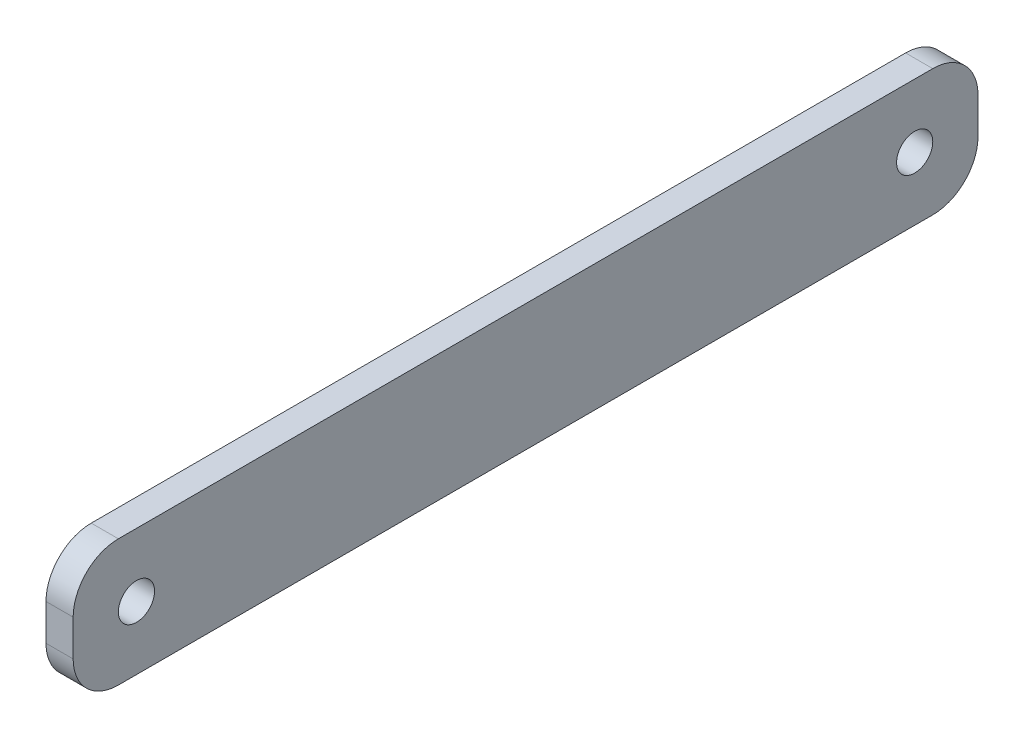
ISO-10303-21;
HEADER;
FILE_DESCRIPTION(('STEP AP214'),'2;1');
FILE_NAME('part.step','',(''),(''),'','','');
FILE_SCHEMA(('AUTOMOTIVE_DESIGN { 1 0 10303 214 1 1 1 1 }'));
ENDSEC;
DATA;
#1=APPLICATION_CONTEXT('core data for automotive mechanical design processes');
#2=APPLICATION_PROTOCOL_DEFINITION('international standard','automotive_design',2000,#1);
#3=PRODUCT_CONTEXT('',#1,'mechanical');
#4=PRODUCT('Part','Part','',(#3));
#5=PRODUCT_RELATED_PRODUCT_CATEGORY('part','',(#4));
#6=PRODUCT_DEFINITION_FORMATION('','',#4);
#7=PRODUCT_DEFINITION_CONTEXT('part definition',#1,'design');
#8=PRODUCT_DEFINITION('design','',#6,#7);
#9=PRODUCT_DEFINITION_SHAPE('','',#8);
#10=(LENGTH_UNIT() NAMED_UNIT(*) SI_UNIT(.MILLI.,.METRE.));
#11=(NAMED_UNIT(*) PLANE_ANGLE_UNIT() SI_UNIT($,.RADIAN.));
#12=(NAMED_UNIT(*) SI_UNIT($,.STERADIAN.) SOLID_ANGLE_UNIT());
#13=UNCERTAINTY_MEASURE_WITH_UNIT(LENGTH_MEASURE(1.E-05),#10,'distance_accuracy_value','');
#14=(GEOMETRIC_REPRESENTATION_CONTEXT(3) GLOBAL_UNCERTAINTY_ASSIGNED_CONTEXT((#13)) GLOBAL_UNIT_ASSIGNED_CONTEXT((#10,
#11,#12)) REPRESENTATION_CONTEXT('',''));
#15=CARTESIAN_POINT('',(0.,0.,0.));
#16=DIRECTION('',(0.,0.,1.));
#17=DIRECTION('',(1.,0.,0.));
#18=AXIS2_PLACEMENT_3D('',#15,#16,#17);
#19=CARTESIAN_POINT('',(3.,0.,0.));
#20=DIRECTION('',(-1.,0.,0.));
#21=DIRECTION('',(0.,0.,1.));
#22=AXIS2_PLACEMENT_3D('',#19,#20,#21);
#23=PLANE('',#22);
#24=DIRECTION('',(0.,-1.,0.));
#25=VECTOR('',#24,1.);
#26=CARTESIAN_POINT('',(3.,0.,0.));
#27=LINE('',#26,#25);
#28=CARTESIAN_POINT('',(3.,9.,0.));
#29=VERTEX_POINT('',#28);
#30=CARTESIAN_POINT('',(3.,5.,0.));
#31=VERTEX_POINT('',#30);
#32=EDGE_CURVE('E140',#29,#31,#27,.T.);
#33=ORIENTED_EDGE('',*,*,#32,.T.);
#34=CARTESIAN_POINT('',(3.,5.,-5.));
#35=DIRECTION('',(-1.,0.,0.));
#36=DIRECTION('',(0.,0.,1.));
#37=AXIS2_PLACEMENT_3D('',#34,#35,#36);
#38=CIRCLE('',#37,5.);
#39=CARTESIAN_POINT('',(3.,0.,-5.));
#40=VERTEX_POINT('',#39);
#41=EDGE_CURVE('E154',#31,#40,#38,.F.);
#42=ORIENTED_EDGE('',*,*,#41,.T.);
#43=DIRECTION('',(0.,0.,-1.));
#44=VECTOR('',#43,1.);
#45=CARTESIAN_POINT('',(3.,0.,0.));
#46=LINE('',#45,#44);
#47=CARTESIAN_POINT('',(3.,0.,-95.));
#48=VERTEX_POINT('',#47);
#49=EDGE_CURVE('E121',#40,#48,#46,.T.);
#50=ORIENTED_EDGE('',*,*,#49,.T.);
#51=CARTESIAN_POINT('',(3.,5.,-95.));
#52=DIRECTION('',(-1.,0.,0.));
#53=DIRECTION('',(0.,0.,1.));
#54=AXIS2_PLACEMENT_3D('',#51,#52,#53);
#55=CIRCLE('',#54,5.);
#56=CARTESIAN_POINT('',(3.,5.,-100.));
#57=VERTEX_POINT('',#56);
#58=EDGE_CURVE('E150',#48,#57,#55,.F.);
#59=ORIENTED_EDGE('',*,*,#58,.T.);
#60=DIRECTION('',(0.,1.,0.));
#61=VECTOR('',#60,1.);
#62=CARTESIAN_POINT('',(3.,0.,-100.));
#63=LINE('',#62,#61);
#64=CARTESIAN_POINT('',(3.,9.,-100.));
#65=VERTEX_POINT('',#64);
#66=EDGE_CURVE('E163',#57,#65,#63,.T.);
#67=ORIENTED_EDGE('',*,*,#66,.T.);
#68=CARTESIAN_POINT('',(3.,9.,-95.));
#69=DIRECTION('',(-1.,0.,0.));
#70=DIRECTION('',(0.,0.,1.));
#71=AXIS2_PLACEMENT_3D('',#68,#69,#70);
#72=CIRCLE('',#71,5.);
#73=CARTESIAN_POINT('',(3.,14.,-95.));
#74=VERTEX_POINT('',#73);
#75=EDGE_CURVE('E56',#65,#74,#72,.F.);
#76=ORIENTED_EDGE('',*,*,#75,.T.);
#77=DIRECTION('',(0.,0.,1.));
#78=VECTOR('',#77,1.);
#79=CARTESIAN_POINT('',(3.,14.,0.));
#80=LINE('',#79,#78);
#81=CARTESIAN_POINT('',(3.,14.,-5.));
#82=VERTEX_POINT('',#81);
#83=EDGE_CURVE('E141',#74,#82,#80,.T.);
#84=ORIENTED_EDGE('',*,*,#83,.T.);
#85=CARTESIAN_POINT('',(3.,9.,-5.));
#86=DIRECTION('',(-1.,0.,0.));
#87=DIRECTION('',(0.,0.,1.));
#88=AXIS2_PLACEMENT_3D('',#85,#86,#87);
#89=CIRCLE('',#88,5.);
#90=EDGE_CURVE('E152',#82,#29,#89,.F.);
#91=ORIENTED_EDGE('',*,*,#90,.T.);
#92=EDGE_LOOP('',(#33,#42,#50,#59,#67,#76,#84,#91));
#93=FACE_BOUND('',#92,.T.);
#94=CARTESIAN_POINT('',(3.,7.,-7.));
#95=DIRECTION('',(1.,0.,0.));
#96=DIRECTION('',(0.,0.,-1.));
#97=AXIS2_PLACEMENT_3D('',#94,#95,#96);
#98=CIRCLE('',#97,2.);
#99=CARTESIAN_POINT('',(3.,7.,-9.));
#100=VERTEX_POINT('',#99);
#101=EDGE_CURVE('E135',#100,#100,#98,.T.);
#102=ORIENTED_EDGE('',*,*,#101,.F.);
#103=EDGE_LOOP('',(#102));
#104=FACE_BOUND('',#103,.T.);
#105=CARTESIAN_POINT('',(3.,7.,-93.));
#106=DIRECTION('',(1.,0.,0.));
#107=DIRECTION('',(0.,0.,-1.));
#108=AXIS2_PLACEMENT_3D('',#105,#106,#107);
#109=CIRCLE('',#108,2.);
#110=CARTESIAN_POINT('',(3.,7.,-95.));
#111=VERTEX_POINT('',#110);
#112=EDGE_CURVE('E186',#111,#111,#109,.T.);
#113=ORIENTED_EDGE('',*,*,#112,.F.);
#114=EDGE_LOOP('',(#113));
#115=FACE_BOUND('',#114,.T.);
#116=ADVANCED_FACE('F34',(#93,#104,#115),#23,.F.);
#117=CARTESIAN_POINT('',(0.,0.,0.));
#118=DIRECTION('',(-1.,0.,0.));
#119=DIRECTION('',(0.,0.,1.));
#120=AXIS2_PLACEMENT_3D('',#117,#118,#119);
#121=PLANE('',#120);
#122=CARTESIAN_POINT('',(0.,7.,-7.));
#123=DIRECTION('',(1.,0.,0.));
#124=DIRECTION('',(0.,0.,-1.));
#125=AXIS2_PLACEMENT_3D('',#122,#123,#124);
#126=CIRCLE('',#125,2.);
#127=CARTESIAN_POINT('',(0.,7.,-9.));
#128=VERTEX_POINT('',#127);
#129=EDGE_CURVE('E183',#128,#128,#126,.T.);
#130=ORIENTED_EDGE('',*,*,#129,.T.);
#131=EDGE_LOOP('',(#130));
#132=FACE_BOUND('',#131,.T.);
#133=DIRECTION('',(0.,0.,-1.));
#134=VECTOR('',#133,1.);
#135=CARTESIAN_POINT('',(0.,0.,0.));
#136=LINE('',#135,#134);
#137=CARTESIAN_POINT('',(0.,0.,-5.));
#138=VERTEX_POINT('',#137);
#139=CARTESIAN_POINT('',(0.,0.,-95.));
#140=VERTEX_POINT('',#139);
#141=EDGE_CURVE('E118',#138,#140,#136,.T.);
#142=ORIENTED_EDGE('',*,*,#141,.F.);
#143=CARTESIAN_POINT('',(0.,5.,-5.));
#144=DIRECTION('',(-1.,0.,0.));
#145=DIRECTION('',(0.,0.,1.));
#146=AXIS2_PLACEMENT_3D('',#143,#144,#145);
#147=CIRCLE('',#146,5.);
#148=CARTESIAN_POINT('',(0.,5.,0.));
#149=VERTEX_POINT('',#148);
#150=EDGE_CURVE('E101',#138,#149,#147,.T.);
#151=ORIENTED_EDGE('',*,*,#150,.T.);
#152=DIRECTION('',(0.,-1.,0.));
#153=VECTOR('',#152,1.);
#154=CARTESIAN_POINT('',(0.,0.,0.));
#155=LINE('',#154,#153);
#156=CARTESIAN_POINT('',(0.,9.,0.));
#157=VERTEX_POINT('',#156);
#158=EDGE_CURVE('E130',#157,#149,#155,.T.);
#159=ORIENTED_EDGE('',*,*,#158,.F.);
#160=CARTESIAN_POINT('',(0.,9.,-5.));
#161=DIRECTION('',(-1.,0.,0.));
#162=DIRECTION('',(0.,0.,1.));
#163=AXIS2_PLACEMENT_3D('',#160,#161,#162);
#164=CIRCLE('',#163,5.);
#165=CARTESIAN_POINT('',(0.,14.,-5.));
#166=VERTEX_POINT('',#165);
#167=EDGE_CURVE('E112',#157,#166,#164,.T.);
#168=ORIENTED_EDGE('',*,*,#167,.T.);
#169=DIRECTION('',(0.,0.,1.));
#170=VECTOR('',#169,1.);
#171=CARTESIAN_POINT('',(0.,14.,0.));
#172=LINE('',#171,#170);
#173=CARTESIAN_POINT('',(0.,14.,-95.));
#174=VERTEX_POINT('',#173);
#175=EDGE_CURVE('E133',#174,#166,#172,.T.);
#176=ORIENTED_EDGE('',*,*,#175,.F.);
#177=CARTESIAN_POINT('',(0.,9.,-95.));
#178=DIRECTION('',(-1.,0.,0.));
#179=DIRECTION('',(0.,0.,1.));
#180=AXIS2_PLACEMENT_3D('',#177,#178,#179);
#181=CIRCLE('',#180,5.);
#182=CARTESIAN_POINT('',(0.,9.,-100.));
#183=VERTEX_POINT('',#182);
#184=EDGE_CURVE('E122',#174,#183,#181,.T.);
#185=ORIENTED_EDGE('',*,*,#184,.T.);
#186=DIRECTION('',(0.,1.,0.));
#187=VECTOR('',#186,1.);
#188=CARTESIAN_POINT('',(0.,0.,-100.));
#189=LINE('',#188,#187);
#190=CARTESIAN_POINT('',(0.,5.,-100.));
#191=VERTEX_POINT('',#190);
#192=EDGE_CURVE('E129',#191,#183,#189,.T.);
#193=ORIENTED_EDGE('',*,*,#192,.F.);
#194=CARTESIAN_POINT('',(0.,5.,-95.));
#195=DIRECTION('',(-1.,0.,0.));
#196=DIRECTION('',(0.,0.,1.));
#197=AXIS2_PLACEMENT_3D('',#194,#195,#196);
#198=CIRCLE('',#197,5.);
#199=EDGE_CURVE('E128',#191,#140,#198,.T.);
#200=ORIENTED_EDGE('',*,*,#199,.T.);
#201=EDGE_LOOP('',(#142,#151,#159,#168,#176,#185,#193,#200));
#202=FACE_BOUND('',#201,.T.);
#203=CARTESIAN_POINT('',(0.,7.,-93.));
#204=DIRECTION('',(1.,0.,0.));
#205=DIRECTION('',(0.,0.,-1.));
#206=AXIS2_PLACEMENT_3D('',#203,#204,#205);
#207=CIRCLE('',#206,2.);
#208=CARTESIAN_POINT('',(0.,7.,-95.));
#209=VERTEX_POINT('',#208);
#210=EDGE_CURVE('E189',#209,#209,#207,.T.);
#211=ORIENTED_EDGE('',*,*,#210,.T.);
#212=EDGE_LOOP('',(#211));
#213=FACE_BOUND('',#212,.T.);
#214=ADVANCED_FACE('F125',(#132,#202,#213),#121,.T.);
#215=CARTESIAN_POINT('',(3.,0.,0.));
#216=DIRECTION('',(0.,0.,-1.));
#217=DIRECTION('',(-1.,0.,0.));
#218=AXIS2_PLACEMENT_3D('',#215,#216,#217);
#219=PLANE('',#218);
#220=ORIENTED_EDGE('',*,*,#158,.T.);
#221=DIRECTION('',(-1.,0.,0.));
#222=VECTOR('',#221,1.);
#223=CARTESIAN_POINT('',(3.,5.,0.));
#224=LINE('',#223,#222);
#225=EDGE_CURVE('E106',#149,#31,#224,.F.);
#226=ORIENTED_EDGE('',*,*,#225,.T.);
#227=ORIENTED_EDGE('',*,*,#32,.F.);
#228=DIRECTION('',(-1.,0.,0.));
#229=VECTOR('',#228,1.);
#230=CARTESIAN_POINT('',(3.,9.,0.));
#231=LINE('',#230,#229);
#232=EDGE_CURVE('E111',#29,#157,#231,.T.);
#233=ORIENTED_EDGE('',*,*,#232,.T.);
#234=EDGE_LOOP('',(#220,#226,#227,#233));
#235=FACE_BOUND('',#234,.T.);
#236=ADVANCED_FACE('F179',(#235),#219,.F.);
#237=CARTESIAN_POINT('',(3.,0.,0.));
#238=DIRECTION('',(0.,1.,0.));
#239=DIRECTION('',(0.,0.,1.));
#240=AXIS2_PLACEMENT_3D('',#237,#238,#239);
#241=PLANE('',#240);
#242=ORIENTED_EDGE('',*,*,#49,.F.);
#243=DIRECTION('',(-1.,0.,0.));
#244=VECTOR('',#243,1.);
#245=CARTESIAN_POINT('',(3.,0.,-5.));
#246=LINE('',#245,#244);
#247=EDGE_CURVE('E105',#40,#138,#246,.T.);
#248=ORIENTED_EDGE('',*,*,#247,.T.);
#249=ORIENTED_EDGE('',*,*,#141,.T.);
#250=DIRECTION('',(-1.,0.,0.));
#251=VECTOR('',#250,1.);
#252=CARTESIAN_POINT('',(3.,0.,-95.));
#253=LINE('',#252,#251);
#254=EDGE_CURVE('E123',#140,#48,#253,.F.);
#255=ORIENTED_EDGE('',*,*,#254,.T.);
#256=EDGE_LOOP('',(#242,#248,#249,#255));
#257=FACE_BOUND('',#256,.T.);
#258=ADVANCED_FACE('F117',(#257),#241,.F.);
#259=CARTESIAN_POINT('',(3.,0.,-100.));
#260=DIRECTION('',(0.,0.,1.));
#261=DIRECTION('',(1.,0.,0.));
#262=AXIS2_PLACEMENT_3D('',#259,#260,#261);
#263=PLANE('',#262);
#264=ORIENTED_EDGE('',*,*,#66,.F.);
#265=DIRECTION('',(-1.,0.,0.));
#266=VECTOR('',#265,1.);
#267=CARTESIAN_POINT('',(3.,5.,-100.));
#268=LINE('',#267,#266);
#269=EDGE_CURVE('E11',#57,#191,#268,.T.);
#270=ORIENTED_EDGE('',*,*,#269,.T.);
#271=ORIENTED_EDGE('',*,*,#192,.T.);
#272=DIRECTION('',(-1.,0.,0.));
#273=VECTOR('',#272,1.);
#274=CARTESIAN_POINT('',(3.,9.,-100.));
#275=LINE('',#274,#273);
#276=EDGE_CURVE('E42',#183,#65,#275,.F.);
#277=ORIENTED_EDGE('',*,*,#276,.T.);
#278=EDGE_LOOP('',(#264,#270,#271,#277));
#279=FACE_BOUND('',#278,.T.);
#280=ADVANCED_FACE('F162',(#279),#263,.F.);
#281=CARTESIAN_POINT('',(3.,14.,0.));
#282=DIRECTION('',(0.,-1.,0.));
#283=DIRECTION('',(0.,0.,-1.));
#284=AXIS2_PLACEMENT_3D('',#281,#282,#283);
#285=PLANE('',#284);
#286=ORIENTED_EDGE('',*,*,#175,.T.);
#287=DIRECTION('',(-1.,0.,0.));
#288=VECTOR('',#287,1.);
#289=CARTESIAN_POINT('',(3.,14.,-5.));
#290=LINE('',#289,#288);
#291=EDGE_CURVE('E49',#166,#82,#290,.F.);
#292=ORIENTED_EDGE('',*,*,#291,.T.);
#293=ORIENTED_EDGE('',*,*,#83,.F.);
#294=DIRECTION('',(-1.,0.,0.));
#295=VECTOR('',#294,1.);
#296=CARTESIAN_POINT('',(3.,14.,-95.));
#297=LINE('',#296,#295);
#298=EDGE_CURVE('E156',#74,#174,#297,.T.);
#299=ORIENTED_EDGE('',*,*,#298,.T.);
#300=EDGE_LOOP('',(#286,#292,#293,#299));
#301=FACE_BOUND('',#300,.T.);
#302=ADVANCED_FACE('F172',(#301),#285,.F.);
#303=CARTESIAN_POINT('',(3.,7.,-7.));
#304=DIRECTION('',(-1.,0.,0.));
#305=DIRECTION('',(0.,0.,1.));
#306=AXIS2_PLACEMENT_3D('',#303,#304,#305);
#307=CYLINDRICAL_SURFACE('',#306,2.);
#308=ORIENTED_EDGE('',*,*,#101,.T.);
#309=EDGE_LOOP('',(#308));
#310=FACE_BOUND('',#309,.T.);
#311=ORIENTED_EDGE('',*,*,#129,.F.);
#312=EDGE_LOOP('',(#311));
#313=FACE_BOUND('',#312,.T.);
#314=ADVANCED_FACE('F206',(#310,#313),#307,.F.);
#315=CARTESIAN_POINT('',(3.,7.,-93.));
#316=DIRECTION('',(-1.,0.,0.));
#317=DIRECTION('',(0.,0.,1.));
#318=AXIS2_PLACEMENT_3D('',#315,#316,#317);
#319=CYLINDRICAL_SURFACE('',#318,2.);
#320=ORIENTED_EDGE('',*,*,#112,.T.);
#321=EDGE_LOOP('',(#320));
#322=FACE_BOUND('',#321,.T.);
#323=ORIENTED_EDGE('',*,*,#210,.F.);
#324=EDGE_LOOP('',(#323));
#325=FACE_BOUND('',#324,.T.);
#326=ADVANCED_FACE('F195',(#322,#325),#319,.F.);
#327=CARTESIAN_POINT('',(3.,5.,-5.));
#328=DIRECTION('',(-1.,0.,0.));
#329=DIRECTION('',(0.,0.,1.));
#330=AXIS2_PLACEMENT_3D('',#327,#328,#329);
#331=CYLINDRICAL_SURFACE('',#330,5.);
#332=ORIENTED_EDGE('',*,*,#41,.F.);
#333=ORIENTED_EDGE('',*,*,#225,.F.);
#334=ORIENTED_EDGE('',*,*,#150,.F.);
#335=ORIENTED_EDGE('',*,*,#247,.F.);
#336=EDGE_LOOP('',(#332,#333,#334,#335));
#337=FACE_BOUND('',#336,.T.);
#338=ADVANCED_FACE('F104',(#337),#331,.T.);
#339=CARTESIAN_POINT('',(3.,9.,-5.));
#340=DIRECTION('',(-1.,0.,0.));
#341=DIRECTION('',(0.,0.,1.));
#342=AXIS2_PLACEMENT_3D('',#339,#340,#341);
#343=CYLINDRICAL_SURFACE('',#342,5.);
#344=ORIENTED_EDGE('',*,*,#90,.F.);
#345=ORIENTED_EDGE('',*,*,#291,.F.);
#346=ORIENTED_EDGE('',*,*,#167,.F.);
#347=ORIENTED_EDGE('',*,*,#232,.F.);
#348=EDGE_LOOP('',(#344,#345,#346,#347));
#349=FACE_BOUND('',#348,.T.);
#350=ADVANCED_FACE('F176',(#349),#343,.T.);
#351=CARTESIAN_POINT('',(3.,5.,-95.));
#352=DIRECTION('',(-1.,0.,0.));
#353=DIRECTION('',(0.,0.,1.));
#354=AXIS2_PLACEMENT_3D('',#351,#352,#353);
#355=CYLINDRICAL_SURFACE('',#354,5.);
#356=ORIENTED_EDGE('',*,*,#58,.F.);
#357=ORIENTED_EDGE('',*,*,#254,.F.);
#358=ORIENTED_EDGE('',*,*,#199,.F.);
#359=ORIENTED_EDGE('',*,*,#269,.F.);
#360=EDGE_LOOP('',(#356,#357,#358,#359));
#361=FACE_BOUND('',#360,.T.);
#362=ADVANCED_FACE('F220',(#361),#355,.T.);
#363=CARTESIAN_POINT('',(3.,9.,-95.));
#364=DIRECTION('',(-1.,0.,0.));
#365=DIRECTION('',(0.,0.,1.));
#366=AXIS2_PLACEMENT_3D('',#363,#364,#365);
#367=CYLINDRICAL_SURFACE('',#366,5.);
#368=ORIENTED_EDGE('',*,*,#75,.F.);
#369=ORIENTED_EDGE('',*,*,#276,.F.);
#370=ORIENTED_EDGE('',*,*,#184,.F.);
#371=ORIENTED_EDGE('',*,*,#298,.F.);
#372=EDGE_LOOP('',(#368,#369,#370,#371));
#373=FACE_BOUND('',#372,.T.);
#374=ADVANCED_FACE('F36',(#373),#367,.T.);
#375=CLOSED_SHELL('',(#116,#214,#236,#258,#280,#302,#314,#326,#338,#350,#362,#374));
#376=MANIFOLD_SOLID_BREP('B2',#375);
#377=ADVANCED_BREP_SHAPE_REPRESENTATION('',(#18,#376),#14);
#378=SHAPE_DEFINITION_REPRESENTATION(#9,#377);
ENDSEC;
END-ISO-10303-21;
